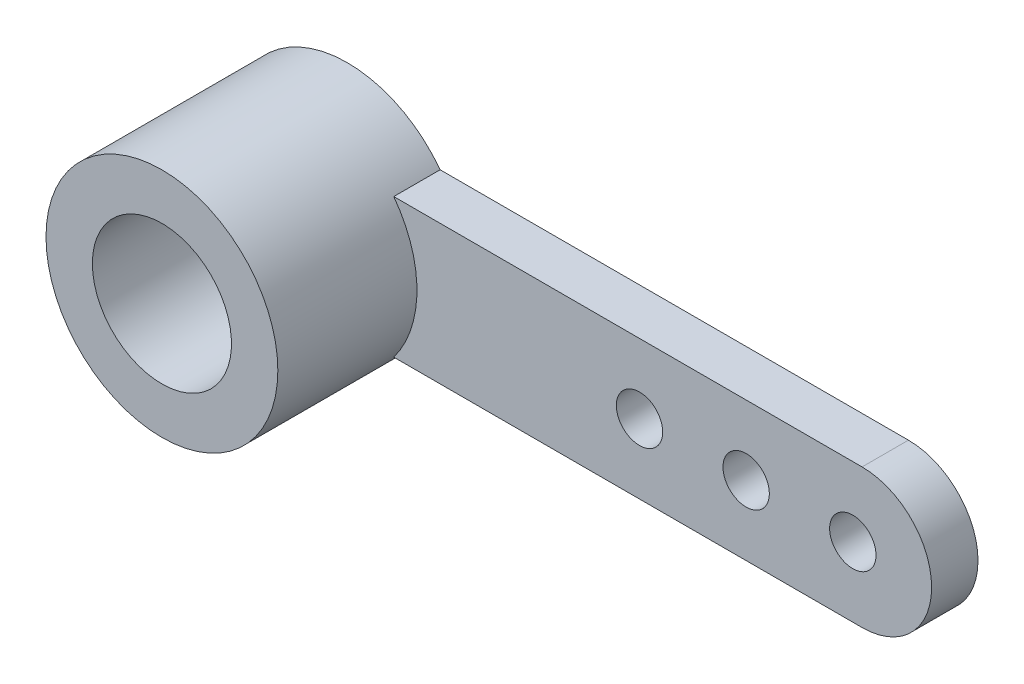
ISO-10303-21;
HEADER;
FILE_DESCRIPTION(('STEP AP214'),'2;1');
FILE_NAME('part.step','',(''),(''),'','','');
FILE_SCHEMA(('AUTOMOTIVE_DESIGN { 1 0 10303 214 1 1 1 1 }'));
ENDSEC;
DATA;
#1=APPLICATION_CONTEXT('core data for automotive mechanical design processes');
#2=APPLICATION_PROTOCOL_DEFINITION('international standard','automotive_design',2000,#1);
#3=PRODUCT_CONTEXT('',#1,'mechanical');
#4=PRODUCT('Part','Part','',(#3));
#5=PRODUCT_RELATED_PRODUCT_CATEGORY('part','',(#4));
#6=PRODUCT_DEFINITION_FORMATION('','',#4);
#7=PRODUCT_DEFINITION_CONTEXT('part definition',#1,'design');
#8=PRODUCT_DEFINITION('design','',#6,#7);
#9=PRODUCT_DEFINITION_SHAPE('','',#8);
#10=(LENGTH_UNIT() NAMED_UNIT(*) SI_UNIT(.MILLI.,.METRE.));
#11=(NAMED_UNIT(*) PLANE_ANGLE_UNIT() SI_UNIT($,.RADIAN.));
#12=(NAMED_UNIT(*) SI_UNIT($,.STERADIAN.) SOLID_ANGLE_UNIT());
#13=UNCERTAINTY_MEASURE_WITH_UNIT(LENGTH_MEASURE(1.E-05),#10,'distance_accuracy_value','');
#14=(GEOMETRIC_REPRESENTATION_CONTEXT(3) GLOBAL_UNCERTAINTY_ASSIGNED_CONTEXT((#13)) GLOBAL_UNIT_ASSIGNED_CONTEXT((#10,
#11,#12)) REPRESENTATION_CONTEXT('',''));
#15=CARTESIAN_POINT('',(0.,0.,0.));
#16=DIRECTION('',(0.,0.,1.));
#17=DIRECTION('',(1.,0.,0.));
#18=AXIS2_PLACEMENT_3D('',#15,#16,#17);
#19=CARTESIAN_POINT('',(12.1,0.,1.));
#20=DIRECTION('',(0.,0.,1.));
#21=DIRECTION('',(1.,0.,0.));
#22=AXIS2_PLACEMENT_3D('',#19,#20,#21);
#23=PLANE('',#22);
#24=CARTESIAN_POINT('',(0.,0.,1.));
#25=DIRECTION('',(0.,0.,-1.));
#26=DIRECTION('',(-1.,0.,0.));
#27=AXIS2_PLACEMENT_3D('',#24,#25,#26);
#28=CIRCLE('',#27,1.5);
#29=CARTESIAN_POINT('',(-1.5,0.,1.));
#30=VERTEX_POINT('',#29);
#31=EDGE_CURVE('E20',#30,#30,#28,.F.);
#32=ORIENTED_EDGE('',*,*,#31,.T.);
#33=EDGE_LOOP('',(#32));
#34=FACE_BOUND('',#33,.T.);
#35=ADVANCED_FACE('F17',(#34),#23,.T.);
#36=CARTESIAN_POINT('',(0.,0.,4.));
#37=DIRECTION('',(0.,0.,-1.));
#38=DIRECTION('',(-1.,0.,0.));
#39=AXIS2_PLACEMENT_3D('',#36,#37,#38);
#40=CYLINDRICAL_SURFACE('',#39,1.5);
#41=CARTESIAN_POINT('',(0.,0.,4.));
#42=DIRECTION('',(0.,0.,-1.));
#43=DIRECTION('',(-1.,0.,0.));
#44=AXIS2_PLACEMENT_3D('',#41,#42,#43);
#45=CIRCLE('',#44,1.5);
#46=CARTESIAN_POINT('',(-1.5,0.,4.));
#47=VERTEX_POINT('',#46);
#48=EDGE_CURVE('E108',#47,#47,#45,.T.);
#49=ORIENTED_EDGE('',*,*,#48,.F.);
#50=EDGE_LOOP('',(#49));
#51=FACE_BOUND('',#50,.T.);
#52=ORIENTED_EDGE('',*,*,#31,.F.);
#53=EDGE_LOOP('',(#52));
#54=FACE_BOUND('',#53,.T.);
#55=ADVANCED_FACE('F116',(#51,#54),#40,.F.);
#56=CARTESIAN_POINT('',(0.,0.,4.));
#57=DIRECTION('',(0.,0.,1.));
#58=DIRECTION('',(1.,0.,0.));
#59=AXIS2_PLACEMENT_3D('',#56,#57,#58);
#60=PLANE('',#59);
#61=ORIENTED_EDGE('',*,*,#48,.T.);
#62=EDGE_LOOP('',(#61));
#63=FACE_BOUND('',#62,.T.);
#64=CARTESIAN_POINT('',(0.,0.,4.));
#65=DIRECTION('',(0.,0.,-1.));
#66=DIRECTION('',(-1.,0.,0.));
#67=AXIS2_PLACEMENT_3D('',#64,#65,#66);
#68=CIRCLE('',#67,2.5);
#69=CARTESIAN_POINT('',(-2.5,0.,4.));
#70=VERTEX_POINT('',#69);
#71=EDGE_CURVE('E65',#70,#70,#68,.T.);
#72=ORIENTED_EDGE('',*,*,#71,.F.);
#73=EDGE_LOOP('',(#72));
#74=FACE_BOUND('',#73,.T.);
#75=ADVANCED_FACE('F118',(#63,#74),#60,.T.);
#76=CARTESIAN_POINT('',(12.1,0.,1.));
#77=DIRECTION('',(0.,0.,1.));
#78=DIRECTION('',(1.,0.,0.));
#79=AXIS2_PLACEMENT_3D('',#76,#77,#78);
#80=PLANE('',#79);
#81=DIRECTION('',(1.,0.,0.));
#82=VECTOR('',#81,1.);
#83=CARTESIAN_POINT('',(12.1,1.5,1.));
#84=LINE('',#83,#82);
#85=CARTESIAN_POINT('',(12.1,1.5,1.));
#86=VERTEX_POINT('',#85);
#87=CARTESIAN_POINT('',(2.,1.5,1.));
#88=VERTEX_POINT('',#87);
#89=EDGE_CURVE('E68',#86,#88,#84,.F.);
#90=ORIENTED_EDGE('',*,*,#89,.T.);
#91=CARTESIAN_POINT('',(0.,0.,1.));
#92=DIRECTION('',(0.,0.,-1.));
#93=DIRECTION('',(-1.,0.,0.));
#94=AXIS2_PLACEMENT_3D('',#91,#92,#93);
#95=CIRCLE('',#94,2.5);
#96=CARTESIAN_POINT('',(2.,-1.5,1.));
#97=VERTEX_POINT('',#96);
#98=EDGE_CURVE('E55',#97,#88,#95,.F.);
#99=ORIENTED_EDGE('',*,*,#98,.F.);
#100=DIRECTION('',(1.,0.,0.));
#101=VECTOR('',#100,1.);
#102=CARTESIAN_POINT('',(12.1,-1.5,1.));
#103=LINE('',#102,#101);
#104=CARTESIAN_POINT('',(12.1,-1.5,1.));
#105=VERTEX_POINT('',#104);
#106=EDGE_CURVE('E86',#97,#105,#103,.T.);
#107=ORIENTED_EDGE('',*,*,#106,.T.);
#108=CARTESIAN_POINT('',(12.1,0.,1.));
#109=DIRECTION('',(0.,0.,-1.));
#110=DIRECTION('',(-1.,0.,0.));
#111=AXIS2_PLACEMENT_3D('',#108,#109,#110);
#112=CIRCLE('',#111,1.5);
#113=EDGE_CURVE('E71',#86,#105,#112,.T.);
#114=ORIENTED_EDGE('',*,*,#113,.F.);
#115=EDGE_LOOP('',(#90,#99,#107,#114));
#116=FACE_BOUND('',#115,.T.);
#117=CARTESIAN_POINT('',(7.3,0.,1.));
#118=DIRECTION('',(0.,0.,1.));
#119=DIRECTION('',(1.,0.,0.));
#120=AXIS2_PLACEMENT_3D('',#117,#118,#119);
#121=CIRCLE('',#120,0.5);
#122=CARTESIAN_POINT('',(7.8,0.,1.));
#123=VERTEX_POINT('',#122);
#124=EDGE_CURVE('E75',#123,#123,#121,.F.);
#125=ORIENTED_EDGE('',*,*,#124,.T.);
#126=EDGE_LOOP('',(#125));
#127=FACE_BOUND('',#126,.T.);
#128=CARTESIAN_POINT('',(9.6,0.,1.));
#129=DIRECTION('',(0.,0.,1.));
#130=DIRECTION('',(1.,0.,0.));
#131=AXIS2_PLACEMENT_3D('',#128,#129,#130);
#132=CIRCLE('',#131,0.499999999999999);
#133=CARTESIAN_POINT('',(10.1,0.,1.));
#134=VERTEX_POINT('',#133);
#135=EDGE_CURVE('E103',#134,#134,#132,.F.);
#136=ORIENTED_EDGE('',*,*,#135,.T.);
#137=EDGE_LOOP('',(#136));
#138=FACE_BOUND('',#137,.T.);
#139=CARTESIAN_POINT('',(11.9,0.,1.));
#140=DIRECTION('',(0.,0.,1.));
#141=DIRECTION('',(1.,0.,0.));
#142=AXIS2_PLACEMENT_3D('',#139,#140,#141);
#143=CIRCLE('',#142,0.499999999999999);
#144=CARTESIAN_POINT('',(12.4,0.,1.));
#145=VERTEX_POINT('',#144);
#146=EDGE_CURVE('E106',#145,#145,#143,.F.);
#147=ORIENTED_EDGE('',*,*,#146,.T.);
#148=EDGE_LOOP('',(#147));
#149=FACE_BOUND('',#148,.T.);
#150=ADVANCED_FACE('F69',(#116,#127,#138,#149),#80,.T.);
#151=CARTESIAN_POINT('',(11.9,0.,-2.));
#152=DIRECTION('',(0.,0.,1.));
#153=DIRECTION('',(1.,0.,0.));
#154=AXIS2_PLACEMENT_3D('',#151,#152,#153);
#155=CYLINDRICAL_SURFACE('',#154,0.499999999999999);
#156=CARTESIAN_POINT('',(11.9,0.,0.));
#157=DIRECTION('',(0.,0.,1.));
#158=DIRECTION('',(1.,0.,0.));
#159=AXIS2_PLACEMENT_3D('',#156,#157,#158);
#160=CIRCLE('',#159,0.499999999999999);
#161=CARTESIAN_POINT('',(12.4,0.,0.));
#162=VERTEX_POINT('',#161);
#163=EDGE_CURVE('E97',#162,#162,#160,.F.);
#164=ORIENTED_EDGE('',*,*,#163,.T.);
#165=EDGE_LOOP('',(#164));
#166=FACE_BOUND('',#165,.T.);
#167=ORIENTED_EDGE('',*,*,#146,.F.);
#168=EDGE_LOOP('',(#167));
#169=FACE_BOUND('',#168,.T.);
#170=ADVANCED_FACE('F154',(#166,#169),#155,.F.);
#171=CARTESIAN_POINT('',(9.6,0.,-2.));
#172=DIRECTION('',(0.,0.,1.));
#173=DIRECTION('',(1.,0.,0.));
#174=AXIS2_PLACEMENT_3D('',#171,#172,#173);
#175=CYLINDRICAL_SURFACE('',#174,0.499999999999999);
#176=CARTESIAN_POINT('',(9.6,0.,0.));
#177=DIRECTION('',(0.,0.,1.));
#178=DIRECTION('',(1.,0.,0.));
#179=AXIS2_PLACEMENT_3D('',#176,#177,#178);
#180=CIRCLE('',#179,0.499999999999999);
#181=CARTESIAN_POINT('',(10.1,0.,0.));
#182=VERTEX_POINT('',#181);
#183=EDGE_CURVE('E94',#182,#182,#180,.F.);
#184=ORIENTED_EDGE('',*,*,#183,.T.);
#185=EDGE_LOOP('',(#184));
#186=FACE_BOUND('',#185,.T.);
#187=ORIENTED_EDGE('',*,*,#135,.F.);
#188=EDGE_LOOP('',(#187));
#189=FACE_BOUND('',#188,.T.);
#190=ADVANCED_FACE('F150',(#186,#189),#175,.F.);
#191=CARTESIAN_POINT('',(7.3,0.,-2.));
#192=DIRECTION('',(0.,0.,1.));
#193=DIRECTION('',(1.,0.,0.));
#194=AXIS2_PLACEMENT_3D('',#191,#192,#193);
#195=CYLINDRICAL_SURFACE('',#194,0.5);
#196=CARTESIAN_POINT('',(7.3,0.,0.));
#197=DIRECTION('',(0.,0.,1.));
#198=DIRECTION('',(1.,0.,0.));
#199=AXIS2_PLACEMENT_3D('',#196,#197,#198);
#200=CIRCLE('',#199,0.5);
#201=CARTESIAN_POINT('',(7.8,0.,0.));
#202=VERTEX_POINT('',#201);
#203=EDGE_CURVE('E91',#202,#202,#200,.F.);
#204=ORIENTED_EDGE('',*,*,#203,.T.);
#205=EDGE_LOOP('',(#204));
#206=FACE_BOUND('',#205,.T.);
#207=ORIENTED_EDGE('',*,*,#124,.F.);
#208=EDGE_LOOP('',(#207));
#209=FACE_BOUND('',#208,.T.);
#210=ADVANCED_FACE('F147',(#206,#209),#195,.F.);
#211=CARTESIAN_POINT('',(12.1,1.5,1.));
#212=DIRECTION('',(0.,-1.,0.));
#213=DIRECTION('',(0.,0.,-1.));
#214=AXIS2_PLACEMENT_3D('',#211,#212,#213);
#215=PLANE('',#214);
#216=DIRECTION('',(0.,0.,-1.));
#217=VECTOR('',#216,1.);
#218=CARTESIAN_POINT('',(2.,1.5,1.));
#219=LINE('',#218,#217);
#220=CARTESIAN_POINT('',(2.,1.5,0.));
#221=VERTEX_POINT('',#220);
#222=EDGE_CURVE('E61',#88,#221,#219,.T.);
#223=ORIENTED_EDGE('',*,*,#222,.F.);
#224=ORIENTED_EDGE('',*,*,#89,.F.);
#225=DIRECTION('',(0.,0.,-1.));
#226=VECTOR('',#225,1.);
#227=CARTESIAN_POINT('',(12.1,1.5,1.));
#228=LINE('',#227,#226);
#229=CARTESIAN_POINT('',(12.1,1.5,0.));
#230=VERTEX_POINT('',#229);
#231=EDGE_CURVE('E87',#230,#86,#228,.F.);
#232=ORIENTED_EDGE('',*,*,#231,.F.);
#233=DIRECTION('',(1.,0.,0.));
#234=VECTOR('',#233,1.);
#235=CARTESIAN_POINT('',(12.1,1.5,0.));
#236=LINE('',#235,#234);
#237=EDGE_CURVE('E79',#230,#221,#236,.F.);
#238=ORIENTED_EDGE('',*,*,#237,.T.);
#239=EDGE_LOOP('',(#223,#224,#232,#238));
#240=FACE_BOUND('',#239,.T.);
#241=ADVANCED_FACE('F78',(#240),#215,.F.);
#242=CARTESIAN_POINT('',(0.,0.,1.));
#243=DIRECTION('',(0.,0.,-1.));
#244=DIRECTION('',(-1.,0.,0.));
#245=AXIS2_PLACEMENT_3D('',#242,#243,#244);
#246=CYLINDRICAL_SURFACE('',#245,2.5);
#247=ORIENTED_EDGE('',*,*,#71,.T.);
#248=EDGE_LOOP('',(#247));
#249=FACE_BOUND('',#248,.T.);
#250=DIRECTION('',(0.,0.,1.));
#251=VECTOR('',#250,1.);
#252=CARTESIAN_POINT('',(2.,-1.5,1.));
#253=LINE('',#252,#251);
#254=CARTESIAN_POINT('',(2.,-1.5,0.));
#255=VERTEX_POINT('',#254);
#256=EDGE_CURVE('E64',#255,#97,#253,.T.);
#257=ORIENTED_EDGE('',*,*,#256,.T.);
#258=ORIENTED_EDGE('',*,*,#98,.T.);
#259=ORIENTED_EDGE('',*,*,#222,.T.);
#260=CARTESIAN_POINT('',(0.,0.,0.));
#261=DIRECTION('',(0.,0.,-1.));
#262=DIRECTION('',(-1.,0.,0.));
#263=AXIS2_PLACEMENT_3D('',#260,#261,#262);
#264=CIRCLE('',#263,2.5);
#265=EDGE_CURVE('E89',#221,#255,#264,.F.);
#266=ORIENTED_EDGE('',*,*,#265,.T.);
#267=EDGE_LOOP('',(#257,#258,#259,#266));
#268=FACE_BOUND('',#267,.T.);
#269=ADVANCED_FACE('F59',(#249,#268),#246,.T.);
#270=CARTESIAN_POINT('',(12.1,-1.5,1.));
#271=DIRECTION('',(0.,1.,0.));
#272=DIRECTION('',(0.,0.,1.));
#273=AXIS2_PLACEMENT_3D('',#270,#271,#272);
#274=PLANE('',#273);
#275=DIRECTION('',(0.,0.,-1.));
#276=VECTOR('',#275,1.);
#277=CARTESIAN_POINT('',(12.1,-1.5,1.));
#278=LINE('',#277,#276);
#279=CARTESIAN_POINT('',(12.1,-1.5,0.));
#280=VERTEX_POINT('',#279);
#281=EDGE_CURVE('E34',#105,#280,#278,.T.);
#282=ORIENTED_EDGE('',*,*,#281,.F.);
#283=ORIENTED_EDGE('',*,*,#106,.F.);
#284=ORIENTED_EDGE('',*,*,#256,.F.);
#285=DIRECTION('',(1.,0.,0.));
#286=VECTOR('',#285,1.);
#287=CARTESIAN_POINT('',(12.1,-1.5,0.));
#288=LINE('',#287,#286);
#289=EDGE_CURVE('E26',#255,#280,#288,.T.);
#290=ORIENTED_EDGE('',*,*,#289,.T.);
#291=EDGE_LOOP('',(#282,#283,#284,#290));
#292=FACE_BOUND('',#291,.T.);
#293=ADVANCED_FACE('F134',(#292),#274,.F.);
#294=CARTESIAN_POINT('',(12.1,0.,1.));
#295=DIRECTION('',(0.,0.,-1.));
#296=DIRECTION('',(-1.,0.,0.));
#297=AXIS2_PLACEMENT_3D('',#294,#295,#296);
#298=CYLINDRICAL_SURFACE('',#297,1.5);
#299=ORIENTED_EDGE('',*,*,#113,.T.);
#300=ORIENTED_EDGE('',*,*,#281,.T.);
#301=CARTESIAN_POINT('',(12.1,0.,0.));
#302=DIRECTION('',(0.,0.,-1.));
#303=DIRECTION('',(-1.,0.,0.));
#304=AXIS2_PLACEMENT_3D('',#301,#302,#303);
#305=CIRCLE('',#304,1.5);
#306=EDGE_CURVE('E11',#280,#230,#305,.F.);
#307=ORIENTED_EDGE('',*,*,#306,.T.);
#308=ORIENTED_EDGE('',*,*,#231,.T.);
#309=EDGE_LOOP('',(#299,#300,#307,#308));
#310=FACE_BOUND('',#309,.T.);
#311=ADVANCED_FACE('F128',(#310),#298,.T.);
#312=CARTESIAN_POINT('',(12.1,0.,0.));
#313=DIRECTION('',(0.,0.,1.));
#314=DIRECTION('',(1.,0.,0.));
#315=AXIS2_PLACEMENT_3D('',#312,#313,#314);
#316=PLANE('',#315);
#317=ORIENTED_EDGE('',*,*,#289,.F.);
#318=ORIENTED_EDGE('',*,*,#265,.F.);
#319=ORIENTED_EDGE('',*,*,#237,.F.);
#320=ORIENTED_EDGE('',*,*,#306,.F.);
#321=EDGE_LOOP('',(#317,#318,#319,#320));
#322=FACE_BOUND('',#321,.T.);
#323=ORIENTED_EDGE('',*,*,#203,.F.);
#324=EDGE_LOOP('',(#323));
#325=FACE_BOUND('',#324,.T.);
#326=ORIENTED_EDGE('',*,*,#183,.F.);
#327=EDGE_LOOP('',(#326));
#328=FACE_BOUND('',#327,.T.);
#329=ORIENTED_EDGE('',*,*,#163,.F.);
#330=EDGE_LOOP('',(#329));
#331=FACE_BOUND('',#330,.T.);
#332=ADVANCED_FACE('F126',(#322,#325,#328,#331),#316,.F.);
#333=CLOSED_SHELL('',(#35,#55,#75,#150,#170,#190,#210,#241,#269,#293,#311,#332));
#334=MANIFOLD_SOLID_BREP('B1',#333);
#335=ADVANCED_BREP_SHAPE_REPRESENTATION('',(#18,#334),#14);
#336=SHAPE_DEFINITION_REPRESENTATION(#9,#335);
ENDSEC;
END-ISO-10303-21;
